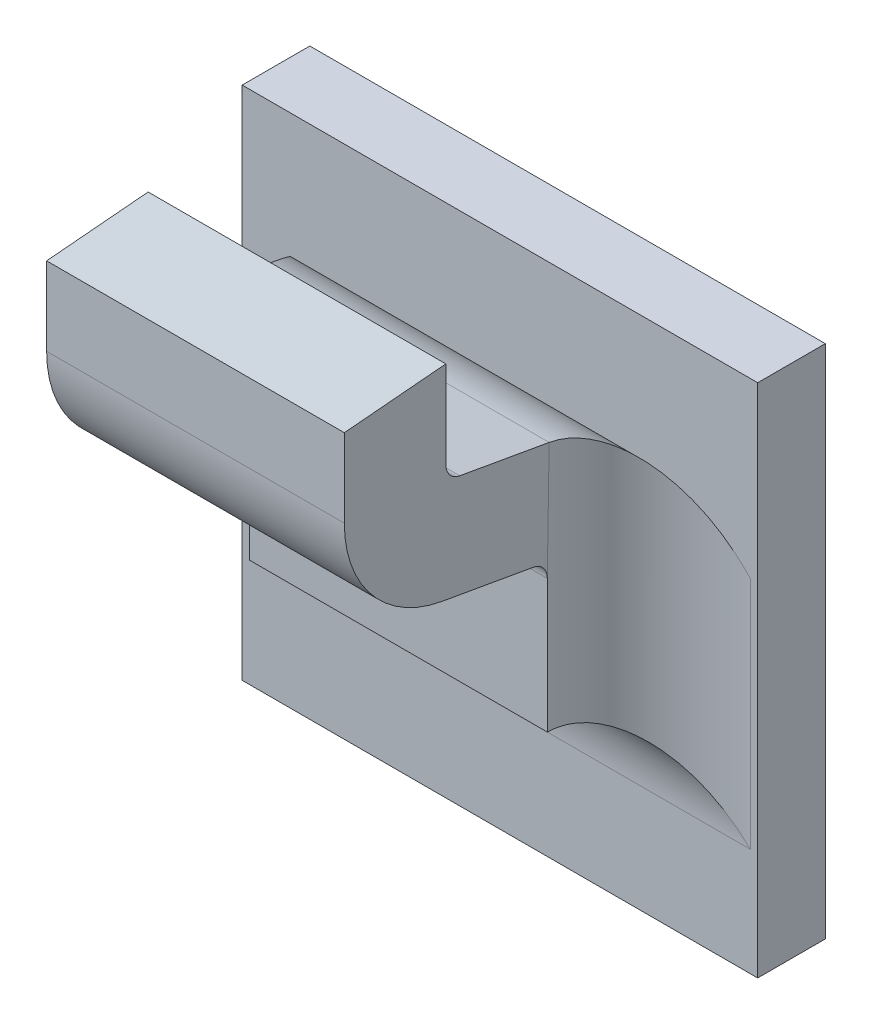
ISO-10303-21;
HEADER;
FILE_DESCRIPTION(('STEP AP214'),'2;1');
FILE_NAME('part.step','',(''),(''),'','','');
FILE_SCHEMA(('AUTOMOTIVE_DESIGN { 1 0 10303 214 1 1 1 1 }'));
ENDSEC;
DATA;
#1=APPLICATION_CONTEXT('core data for automotive mechanical design processes');
#2=APPLICATION_PROTOCOL_DEFINITION('international standard','automotive_design',2000,#1);
#3=PRODUCT_CONTEXT('',#1,'mechanical');
#4=PRODUCT('Part','Part','',(#3));
#5=PRODUCT_RELATED_PRODUCT_CATEGORY('part','',(#4));
#6=PRODUCT_DEFINITION_FORMATION('','',#4);
#7=PRODUCT_DEFINITION_CONTEXT('part definition',#1,'design');
#8=PRODUCT_DEFINITION('design','',#6,#7);
#9=PRODUCT_DEFINITION_SHAPE('','',#8);
#10=(LENGTH_UNIT() NAMED_UNIT(*) SI_UNIT(.MILLI.,.METRE.));
#11=(NAMED_UNIT(*) PLANE_ANGLE_UNIT() SI_UNIT($,.RADIAN.));
#12=(NAMED_UNIT(*) SI_UNIT($,.STERADIAN.) SOLID_ANGLE_UNIT());
#13=UNCERTAINTY_MEASURE_WITH_UNIT(LENGTH_MEASURE(1.E-05),#10,'distance_accuracy_value','');
#14=(GEOMETRIC_REPRESENTATION_CONTEXT(3) GLOBAL_UNCERTAINTY_ASSIGNED_CONTEXT((#13)) GLOBAL_UNIT_ASSIGNED_CONTEXT((#10,
#11,#12)) REPRESENTATION_CONTEXT('',''));
#15=CARTESIAN_POINT('',(0.,0.,0.));
#16=DIRECTION('',(0.,0.,1.));
#17=DIRECTION('',(1.,0.,0.));
#18=AXIS2_PLACEMENT_3D('',#15,#16,#17);
#19=CARTESIAN_POINT('',(0.109690982808015,-0.482280853090536,0.0797273267071123));
#20=DIRECTION('',(1.,0.,0.));
#21=DIRECTION('',(0.,1.,0.));
#22=AXIS2_PLACEMENT_3D('',#19,#20,#21);
#23=CYLINDRICAL_SURFACE('',#22,0.00098425196850394);
#24=DIRECTION('',(1.,0.,0.));
#25=VECTOR('',#24,1.);
#26=CARTESIAN_POINT('',(0.0906358646977785,-0.482280853090536,0.0807115786756163));
#27=LINE('',#26,#25);
#28=CARTESIAN_POINT('',(0.108824841075731,-0.482280853090536,0.0807115786756163));
#29=VERTEX_POINT('',#28);
#30=CARTESIAN_POINT('',(0.091502006430062,-0.482280853090536,0.0807115786756163));
#31=VERTEX_POINT('',#30);
#32=EDGE_CURVE('E182',#29,#31,#27,.F.);
#33=ORIENTED_EDGE('',*,*,#32,.F.);
#34=CARTESIAN_POINT('',(0.108824841075731,-0.482280853090536,0.0797273267071123));
#35=DIRECTION('',(1.,0.,0.));
#36=DIRECTION('',(0.,1.,0.));
#37=AXIS2_PLACEMENT_3D('',#34,#35,#36);
#38=CIRCLE('',#37,0.00098425196850394);
#39=CARTESIAN_POINT('',(0.108824841075731,-0.483250152060037,0.0798982402678082));
#40=VERTEX_POINT('',#39);
#41=EDGE_CURVE('E155',#40,#29,#38,.F.);
#42=ORIENTED_EDGE('',*,*,#41,.F.);
#43=DIRECTION('',(1.,0.,0.));
#44=VECTOR('',#43,1.);
#45=CARTESIAN_POINT('',(0.0906316719131204,-0.483250152060037,0.0798982402678081));
#46=LINE('',#45,#44);
#47=CARTESIAN_POINT('',(0.091502006430062,-0.483250152060037,0.0798982402678082));
#48=VERTEX_POINT('',#47);
#49=EDGE_CURVE('E137',#48,#40,#46,.T.);
#50=ORIENTED_EDGE('',*,*,#49,.F.);
#51=CARTESIAN_POINT('',(0.091502006430062,-0.482280853090536,0.0797273267071123));
#52=DIRECTION('',(1.,0.,0.));
#53=DIRECTION('',(0.,1.,0.));
#54=AXIS2_PLACEMENT_3D('',#51,#52,#53);
#55=CIRCLE('',#54,0.00098425196850394);
#56=EDGE_CURVE('E148',#48,#31,#55,.F.);
#57=ORIENTED_EDGE('',*,*,#56,.T.);
#58=EDGE_LOOP('',(#33,#42,#50,#57));
#59=FACE_BOUND('',#58,.T.);
#60=ADVANCED_FACE('F17',(#59),#23,.F.);
#61=CARTESIAN_POINT('',(0.0906358646977785,-0.482534695884412,0.0807115786756163));
#62=DIRECTION('',(0.,0.,-1.));
#63=DIRECTION('',(0.,1.,0.));
#64=AXIS2_PLACEMENT_3D('',#61,#62,#63);
#65=PLANE('',#64);
#66=ORIENTED_EDGE('',*,*,#32,.T.);
#67=DIRECTION('',(0.,1.,0.));
#68=VECTOR('',#67,1.);
#69=CARTESIAN_POINT('',(0.091502006430062,-0.491658866021041,0.0807115786756163));
#70=LINE('',#69,#68);
#71=CARTESIAN_POINT('',(0.091502006430062,-0.477203997213029,0.0807115786756163));
#72=VERTEX_POINT('',#71);
#73=EDGE_CURVE('E177',#31,#72,#70,.T.);
#74=ORIENTED_EDGE('',*,*,#73,.T.);
#75=DIRECTION('',(1.,0.,0.));
#76=VECTOR('',#75,1.);
#77=CARTESIAN_POINT('',(0.137663423752897,-0.477203997213029,0.0807115786756163));
#78=LINE('',#77,#76);
#79=CARTESIAN_POINT('',(0.108824841075731,-0.477203997213029,0.0807115786756163));
#80=VERTEX_POINT('',#79);
#81=EDGE_CURVE('E170',#72,#80,#78,.T.);
#82=ORIENTED_EDGE('',*,*,#81,.T.);
#83=DIRECTION('',(0.,1.,0.));
#84=VECTOR('',#83,1.);
#85=CARTESIAN_POINT('',(0.108824841075731,-0.491658866021041,0.0807115786756163));
#86=LINE('',#85,#84);
#87=EDGE_CURVE('E189',#29,#80,#86,.T.);
#88=ORIENTED_EDGE('',*,*,#87,.F.);
#89=EDGE_LOOP('',(#66,#74,#82,#88));
#90=FACE_BOUND('',#89,.T.);
#91=ADVANCED_FACE('F376',(#90),#65,.T.);
#92=CARTESIAN_POINT('',(0.137663423752897,-0.477562594630968,0.0848103659183002));
#93=DIRECTION('',(0.,-0.996194698091746,-0.0871557427476516));
#94=DIRECTION('',(0.,0.0871557427476516,-0.996194698091746));
#95=AXIS2_PLACEMENT_3D('',#92,#93,#94);
#96=PLANE('',#95);
#97=DIRECTION('',(0.,-0.0871557427476615,0.996194698091745));
#98=VECTOR('',#97,1.);
#99=CARTESIAN_POINT('',(0.091502006430062,-0.477203997213029,0.0807115786756163));
#100=LINE('',#99,#98);
#101=CARTESIAN_POINT('',(0.091502006430062,-0.477720662548812,0.08661709048664));
#102=VERTEX_POINT('',#101);
#103=EDGE_CURVE('E173',#72,#102,#100,.T.);
#104=ORIENTED_EDGE('',*,*,#103,.T.);
#105=DIRECTION('',(1.,0.,0.));
#106=VECTOR('',#105,1.);
#107=CARTESIAN_POINT('',(0.0906358646977785,-0.477720662548812,0.0866170904866399));
#108=LINE('',#107,#106);
#109=CARTESIAN_POINT('',(0.108824841075731,-0.477720662548812,0.0866170904866399));
#110=VERTEX_POINT('',#109);
#111=EDGE_CURVE('E167',#102,#110,#108,.T.);
#112=ORIENTED_EDGE('',*,*,#111,.T.);
#113=DIRECTION('',(0.,-0.0871557427476615,0.996194698091745));
#114=VECTOR('',#113,1.);
#115=CARTESIAN_POINT('',(0.108824841075731,-0.477203997213029,0.0807115786756163));
#116=LINE('',#115,#114);
#117=EDGE_CURVE('E186',#80,#110,#116,.T.);
#118=ORIENTED_EDGE('',*,*,#117,.F.);
#119=ORIENTED_EDGE('',*,*,#81,.F.);
#120=EDGE_LOOP('',(#104,#112,#118,#119));
#121=FACE_BOUND('',#120,.T.);
#122=ADVANCED_FACE('F380',(#121),#96,.F.);
#123=CARTESIAN_POINT('',(0.0906358646977785,-0.482508862617623,0.0866170904866399));
#124=DIRECTION('',(0.,0.,-1.));
#125=DIRECTION('',(0.,1.,0.));
#126=AXIS2_PLACEMENT_3D('',#123,#124,#125);
#127=PLANE('',#126);
#128=ORIENTED_EDGE('',*,*,#111,.F.);
#129=DIRECTION('',(0.,1.,0.));
#130=VECTOR('',#129,1.);
#131=CARTESIAN_POINT('',(0.091502006430062,-0.491658866021041,0.08661709048664));
#132=LINE('',#131,#130);
#133=CARTESIAN_POINT('',(0.091502006430062,-0.482280853090536,0.0866170904866399));
#134=VERTEX_POINT('',#133);
#135=EDGE_CURVE('E176',#102,#134,#132,.F.);
#136=ORIENTED_EDGE('',*,*,#135,.T.);
#137=DIRECTION('',(1.,0.,0.));
#138=VECTOR('',#137,1.);
#139=CARTESIAN_POINT('',(0.109690982808015,-0.482280853090536,0.0866170904866399));
#140=LINE('',#139,#138);
#141=CARTESIAN_POINT('',(0.108824841075731,-0.482280853090536,0.0866170904866399));
#142=VERTEX_POINT('',#141);
#143=EDGE_CURVE('E165',#142,#134,#140,.F.);
#144=ORIENTED_EDGE('',*,*,#143,.F.);
#145=DIRECTION('',(0.,1.,0.));
#146=VECTOR('',#145,1.);
#147=CARTESIAN_POINT('',(0.108824841075731,-0.491658866021041,0.08661709048664));
#148=LINE('',#147,#146);
#149=EDGE_CURVE('E188',#110,#142,#148,.F.);
#150=ORIENTED_EDGE('',*,*,#149,.F.);
#151=EDGE_LOOP('',(#128,#136,#144,#150));
#152=FACE_BOUND('',#151,.T.);
#153=ADVANCED_FACE('F384',(#152),#127,.F.);
#154=CARTESIAN_POINT('',(0.109690982808015,-0.482280853090536,0.0797273267071123));
#155=DIRECTION('',(1.,0.,0.));
#156=DIRECTION('',(0.,1.,0.));
#157=AXIS2_PLACEMENT_3D('',#154,#155,#156);
#158=CYLINDRICAL_SURFACE('',#157,0.00688976377952756);
#159=CARTESIAN_POINT('',(0.108824841075731,-0.482280853090536,0.0797273267071123));
#160=DIRECTION('',(1.,0.,0.));
#161=DIRECTION('',(0.,1.,0.));
#162=AXIS2_PLACEMENT_3D('',#159,#160,#161);
#163=CIRCLE('',#162,0.00688976377952756);
#164=CARTESIAN_POINT('',(0.108824841075731,-0.489065945877038,0.0809237216319825));
#165=VERTEX_POINT('',#164);
#166=EDGE_CURVE('E146',#142,#165,#163,.T.);
#167=ORIENTED_EDGE('',*,*,#166,.F.);
#168=ORIENTED_EDGE('',*,*,#143,.T.);
#169=CARTESIAN_POINT('',(0.091502006430062,-0.482280853090536,0.0797273267071123));
#170=DIRECTION('',(1.,0.,0.));
#171=DIRECTION('',(0.,1.,0.));
#172=AXIS2_PLACEMENT_3D('',#169,#170,#171);
#173=CIRCLE('',#172,0.00688976377952756);
#174=CARTESIAN_POINT('',(0.091502006430062,-0.489065945877038,0.0809237216319825));
#175=VERTEX_POINT('',#174);
#176=EDGE_CURVE('E235',#134,#175,#173,.T.);
#177=ORIENTED_EDGE('',*,*,#176,.T.);
#178=DIRECTION('',(1.,0.,0.));
#179=VECTOR('',#178,1.);
#180=CARTESIAN_POINT('',(0.0906358646977785,-0.489065945877038,0.0809237216319829));
#181=LINE('',#180,#179);
#182=EDGE_CURVE('E138',#175,#165,#181,.T.);
#183=ORIENTED_EDGE('',*,*,#182,.T.);
#184=EDGE_LOOP('',(#167,#168,#177,#183));
#185=FACE_BOUND('',#184,.T.);
#186=ADVANCED_FACE('F388',(#185),#158,.T.);
#187=CARTESIAN_POINT('',(0.0906358646977785,-0.490048004669866,0.0753541894544217));
#188=DIRECTION('',(0.,0.984807753012208,-0.17364817766693));
#189=DIRECTION('',(0.,0.17364817766693,0.984807753012208));
#190=AXIS2_PLACEMENT_3D('',#187,#188,#189);
#191=PLANE('',#190);
#192=DIRECTION('',(1.,0.,0.));
#193=VECTOR('',#192,1.);
#194=CARTESIAN_POINT('',(0.109690982808015,-0.490001239965446,0.0756194052724009));
#195=LINE('',#194,#193);
#196=CARTESIAN_POINT('',(0.091502006430062,-0.490001239965445,0.0756194052724009));
#197=VERTEX_POINT('',#196);
#198=CARTESIAN_POINT('',(0.108824841075731,-0.490001239965445,0.0756194052724009));
#199=VERTEX_POINT('',#198);
#200=EDGE_CURVE('E127',#197,#199,#195,.T.);
#201=ORIENTED_EDGE('',*,*,#200,.T.);
#202=DIRECTION('',(0.,-0.173648177666803,-0.98480775301223));
#203=VECTOR('',#202,1.);
#204=CARTESIAN_POINT('',(0.108824841075731,-0.489065945877038,0.0809237216319829));
#205=LINE('',#204,#203);
#206=EDGE_CURVE('E130',#165,#199,#205,.T.);
#207=ORIENTED_EDGE('',*,*,#206,.F.);
#208=ORIENTED_EDGE('',*,*,#182,.F.);
#209=DIRECTION('',(0.,-0.173648177666803,-0.98480775301223));
#210=VECTOR('',#209,1.);
#211=CARTESIAN_POINT('',(0.091502006430062,-0.489065945877038,0.0809237216319829));
#212=LINE('',#211,#210);
#213=EDGE_CURVE('E132',#175,#197,#212,.T.);
#214=ORIENTED_EDGE('',*,*,#213,.T.);
#215=EDGE_LOOP('',(#201,#207,#208,#214));
#216=FACE_BOUND('',#215,.T.);
#217=ADVANCED_FACE('F129',(#216),#191,.F.);
#218=CARTESIAN_POINT('',(0.109690982808015,-0.490970538934946,0.0757903188330966));
#219=DIRECTION('',(1.,0.,0.));
#220=DIRECTION('',(0.,1.,0.));
#221=AXIS2_PLACEMENT_3D('',#218,#219,#220);
#222=CYLINDRICAL_SURFACE('',#221,0.00098425196850394);
#223=DIRECTION('',(1.,0.,0.));
#224=VECTOR('',#223,1.);
#225=CARTESIAN_POINT('',(0.0906358646977785,-0.490970538934946,0.0748060668645926));
#226=LINE('',#225,#224);
#227=CARTESIAN_POINT('',(0.091502006430062,-0.490970538934946,0.0748060668645927));
#228=VERTEX_POINT('',#227);
#229=CARTESIAN_POINT('',(0.108824841075731,-0.490970538934946,0.0748060668645926));
#230=VERTEX_POINT('',#229);
#231=EDGE_CURVE('E151',#228,#230,#226,.T.);
#232=ORIENTED_EDGE('',*,*,#231,.T.);
#233=CARTESIAN_POINT('',(0.108824841075731,-0.490970538934946,0.0757903188330966));
#234=DIRECTION('',(1.,0.,0.));
#235=DIRECTION('',(0.,1.,0.));
#236=AXIS2_PLACEMENT_3D('',#233,#234,#235);
#237=CIRCLE('',#236,0.00098425196850394);
#238=EDGE_CURVE('E20',#199,#230,#237,.F.);
#239=ORIENTED_EDGE('',*,*,#238,.F.);
#240=ORIENTED_EDGE('',*,*,#200,.F.);
#241=CARTESIAN_POINT('',(0.091502006430062,-0.490970538934946,0.0757903188330966));
#242=DIRECTION('',(1.,0.,0.));
#243=DIRECTION('',(0.,1.,0.));
#244=AXIS2_PLACEMENT_3D('',#241,#242,#243);
#245=CIRCLE('',#244,0.00098425196850394);
#246=EDGE_CURVE('E232',#197,#228,#245,.F.);
#247=ORIENTED_EDGE('',*,*,#246,.T.);
#248=EDGE_LOOP('',(#232,#239,#240,#247));
#249=FACE_BOUND('',#248,.T.);
#250=ADVANCED_FACE('F150',(#249),#222,.F.);
#251=CARTESIAN_POINT('',(0.0906316719131204,-0.484232210852865,0.0743287080902469));
#252=DIRECTION('',(0.,0.984807753012208,-0.17364817766693));
#253=DIRECTION('',(0.,0.17364817766693,0.984807753012208));
#254=AXIS2_PLACEMENT_3D('',#251,#252,#253);
#255=PLANE('',#254);
#256=DIRECTION('',(0.,0.173648177666938,0.984807753012207));
#257=VECTOR('',#256,1.);
#258=CARTESIAN_POINT('',(0.108824841075731,-0.48414803962147,0.0748060668645927));
#259=LINE('',#258,#257);
#260=CARTESIAN_POINT('',(0.10882674688694,-0.484166742884957,0.0746999953864093));
#261=VERTEX_POINT('',#260);
#262=EDGE_CURVE('E153',#261,#40,#259,.T.);
#263=ORIENTED_EDGE('',*,*,#262,.F.);
#264=DIRECTION('',(1.,0.,0.));
#265=VECTOR('',#264,1.);
#266=CARTESIAN_POINT('',(0.116187045800141,-0.484185446148445,0.0745939239082261));
#267=LINE('',#266,#265);
#268=CARTESIAN_POINT('',(0.0915001006188538,-0.484166742884957,0.0746999953864093));
#269=VERTEX_POINT('',#268);
#270=EDGE_CURVE('E264',#269,#261,#267,.T.);
#271=ORIENTED_EDGE('',*,*,#270,.F.);
#272=DIRECTION('',(0.,0.173648177666938,0.984807753012207));
#273=VECTOR('',#272,1.);
#274=CARTESIAN_POINT('',(0.091502006430062,-0.48414803962147,0.0748060668645927));
#275=LINE('',#274,#273);
#276=EDGE_CURVE('E234',#269,#48,#275,.T.);
#277=ORIENTED_EDGE('',*,*,#276,.T.);
#278=ORIENTED_EDGE('',*,*,#49,.T.);
#279=EDGE_LOOP('',(#263,#271,#277,#278));
#280=FACE_BOUND('',#279,.T.);
#281=ADVANCED_FACE('F373',(#280),#255,.T.);
#282=CARTESIAN_POINT('',(0.108824841075731,-0.491658866021041,0.0742155156834903));
#283=DIRECTION('',(1.,0.,0.));
#284=DIRECTION('',(0.,1.,0.));
#285=AXIS2_PLACEMENT_3D('',#282,#283,#284);
#286=PLANE('',#285);
#287=ORIENTED_EDGE('',*,*,#166,.T.);
#288=ORIENTED_EDGE('',*,*,#206,.T.);
#289=ORIENTED_EDGE('',*,*,#238,.T.);
#290=DIRECTION('',(0.,-1.,0.));
#291=VECTOR('',#290,1.);
#292=CARTESIAN_POINT('',(0.108824841075731,-0.505642557779639,0.0748060668645926));
#293=LINE('',#292,#291);
#294=EDGE_CURVE('E271',#230,#261,#293,.F.);
#295=ORIENTED_EDGE('',*,*,#294,.T.);
#296=ORIENTED_EDGE('',*,*,#262,.T.);
#297=ORIENTED_EDGE('',*,*,#41,.T.);
#298=ORIENTED_EDGE('',*,*,#87,.T.);
#299=ORIENTED_EDGE('',*,*,#117,.T.);
#300=ORIENTED_EDGE('',*,*,#149,.T.);
#301=EDGE_LOOP('',(#287,#288,#289,#295,#296,#297,#298,#299,#300));
#302=FACE_BOUND('',#301,.T.);
#303=ADVANCED_FACE('F142',(#302),#286,.T.);
#304=CARTESIAN_POINT('',(0.091502006430062,-0.491658866021041,0.0742155156834903));
#305=DIRECTION('',(1.,0.,0.));
#306=DIRECTION('',(0.,1.,0.));
#307=AXIS2_PLACEMENT_3D('',#304,#305,#306);
#308=PLANE('',#307);
#309=DIRECTION('',(0.,1.,0.));
#310=VECTOR('',#309,1.);
#311=CARTESIAN_POINT('',(0.091502006430062,-0.483124491137747,0.0748060668645927));
#312=LINE('',#311,#310);
#313=EDGE_CURVE('E290',#269,#228,#312,.F.);
#314=ORIENTED_EDGE('',*,*,#313,.T.);
#315=ORIENTED_EDGE('',*,*,#246,.F.);
#316=ORIENTED_EDGE('',*,*,#213,.F.);
#317=ORIENTED_EDGE('',*,*,#176,.F.);
#318=ORIENTED_EDGE('',*,*,#135,.F.);
#319=ORIENTED_EDGE('',*,*,#103,.F.);
#320=ORIENTED_EDGE('',*,*,#73,.F.);
#321=ORIENTED_EDGE('',*,*,#56,.F.);
#322=ORIENTED_EDGE('',*,*,#276,.F.);
#323=EDGE_LOOP('',(#314,#315,#316,#317,#318,#319,#320,#321,#322));
#324=FACE_BOUND('',#323,.T.);
#325=ADVANCED_FACE('F371',(#324),#308,.F.);
#326=CARTESIAN_POINT('',(0.0906358646977785,-0.49910064541239,0.0748060668645926));
#327=DIRECTION('',(0.,0.,-1.));
#328=DIRECTION('',(0.,1.,0.));
#329=AXIS2_PLACEMENT_3D('',#326,#327,#328);
#330=PLANE('',#329);
#331=DIRECTION('',(-1.,0.,0.));
#332=VECTOR('',#331,1.);
#333=CARTESIAN_POINT('',(0.0841398017056525,-0.498713497484892,0.0748060668645926));
#334=LINE('',#333,#332);
#335=CARTESIAN_POINT('',(0.091502006430062,-0.498713497484892,0.0748060668645926));
#336=VERTEX_POINT('',#335);
#337=CARTESIAN_POINT('',(0.108824841075731,-0.498713497484892,0.0748060668645926));
#338=VERTEX_POINT('',#337);
#339=EDGE_CURVE('E275',#336,#338,#334,.F.);
#340=ORIENTED_EDGE('',*,*,#339,.T.);
#341=DIRECTION('',(0.,-1.,0.));
#342=VECTOR('',#341,1.);
#343=CARTESIAN_POINT('',(0.108824841075731,-0.505642557779639,0.0748060668645926));
#344=LINE('',#343,#342);
#345=EDGE_CURVE('E268',#338,#230,#344,.F.);
#346=ORIENTED_EDGE('',*,*,#345,.T.);
#347=ORIENTED_EDGE('',*,*,#231,.F.);
#348=DIRECTION('',(0.,1.,0.));
#349=VECTOR('',#348,1.);
#350=CARTESIAN_POINT('',(0.091502006430062,-0.483124491137747,0.0748060668645926));
#351=LINE('',#350,#349);
#352=EDGE_CURVE('E293',#228,#336,#351,.F.);
#353=ORIENTED_EDGE('',*,*,#352,.T.);
#354=EDGE_LOOP('',(#340,#346,#347,#353));
#355=FACE_BOUND('',#354,.T.);
#356=ADVANCED_FACE('F369',(#355),#330,.F.);
#357=CARTESIAN_POINT('',(0.116187045800141,-0.490970538934946,0.0757903188330966));
#358=DIRECTION('',(1.,0.,0.));
#359=DIRECTION('',(0.,1.,0.));
#360=AXIS2_PLACEMENT_3D('',#357,#358,#359);
#361=CYLINDRICAL_SURFACE('',#360,0.00688976377952756);
#362=ORIENTED_EDGE('',*,*,#270,.T.);
#363=CARTESIAN_POINT('',(0.10882584705188,-0.484167631527071,0.0747001216257358));
#364=CARTESIAN_POINT('',(0.108830746400047,-0.484214408974995,0.0744052234333631));
#365=CARTESIAN_POINT('',(0.108858349030783,-0.484280966886792,0.0741150341517891));
#366=CARTESIAN_POINT('',(0.108952289382906,-0.484447482121032,0.073553844729337));
#367=CARTESIAN_POINT('',(0.109018258902216,-0.484547118148503,0.0732826892737776));
#368=CARTESIAN_POINT('',(0.109182242620427,-0.484774233375055,0.0727646055784552));
#369=CARTESIAN_POINT('',(0.109280119745007,-0.484901592711233,0.0725175794773051));
#370=CARTESIAN_POINT('',(0.109501721201638,-0.485178958131144,0.0720485533086557));
#371=CARTESIAN_POINT('',(0.109625512286216,-0.485329022418919,0.0718266201983146));
#372=CARTESIAN_POINT('',(0.109961780246565,-0.485728040852456,0.0713022915327615));
#373=CARTESIAN_POINT('',(0.110187229821375,-0.485988312130857,0.0710168133445037));
#374=CARTESIAN_POINT('',(0.110669306450927,-0.486535947935682,0.070504056702723));
#375=CARTESIAN_POINT('',(0.110926004972526,-0.486823374216995,0.0702769154978245));
#376=CARTESIAN_POINT('',(0.111560055176599,-0.487527037812419,0.0698026326616958));
#377=CARTESIAN_POINT('',(0.111946643806099,-0.487951268913421,0.0695797433223629));
#378=CARTESIAN_POINT('',(0.112740499974624,-0.488817388979215,0.0692289934880923));
#379=CARTESIAN_POINT('',(0.113147751769603,-0.489259264447,0.0691010617693635));
#380=CARTESIAN_POINT('',(0.113829419657663,-0.489997147024509,0.0689631980798835));
#381=CARTESIAN_POINT('',(0.114101299537579,-0.490291001061431,0.0689278051732856));
#382=CARTESIAN_POINT('',(0.114492532956124,-0.490713663984163,0.0689041494171859));
#383=CARTESIAN_POINT('',(0.114611448383415,-0.490842107141949,0.068900564537093));
#384=CARTESIAN_POINT('',(0.114730352886755,-0.490970538934946,0.068900555053569));
#385=B_SPLINE_CURVE_WITH_KNOTS('',3,(#363,#364,#365,#366,#367,#368,#369,#370,#371,#372,#373,
#374,#375,#376,#377,#378,#379,#380,#381,#382,#383,#384),.UNSPECIFIED.,.F.,.F.,(4,2,2,2,2,2,2,2,
2,2,4),(0.,0.000892674275674719,0.00177691981761761,0.00265741564567001,0.00354020811045546,
0.00487460341316197,0.00621210995073976,0.00804949445936676,0.00988549942521252,0.011089431284,
0.0116145091100796),.UNSPECIFIED.);
#386=CARTESIAN_POINT('',(0.114730352886755,-0.490970538934946,0.068900555053569));
#387=VERTEX_POINT('',#386);
#388=EDGE_CURVE('E231',#261,#387,#385,.T.);
#389=ORIENTED_EDGE('',*,*,#388,.T.);
#390=DIRECTION('',(1.,0.,0.));
#391=VECTOR('',#390,1.);
#392=CARTESIAN_POINT('',(0.0836634237528968,-0.490970538934946,0.068900555053569));
#393=LINE('',#392,#391);
#394=CARTESIAN_POINT('',(0.0855964946190384,-0.490970538934946,0.068900555053569));
#395=VERTEX_POINT('',#394);
#396=EDGE_CURVE('E195',#395,#387,#393,.T.);
#397=ORIENTED_EDGE('',*,*,#396,.F.);
#398=CARTESIAN_POINT('',(0.0915010004539131,-0.484167631527071,0.0747001216257358));
#399=CARTESIAN_POINT('',(0.091496101105746,-0.484214408974995,0.0744052234333631));
#400=CARTESIAN_POINT('',(0.0914684984750102,-0.484280966886792,0.0741150341517891));
#401=CARTESIAN_POINT('',(0.0913745581228873,-0.484447482121032,0.073553844729337));
#402=CARTESIAN_POINT('',(0.0913085886035777,-0.484547118148504,0.0732826892737777));
#403=CARTESIAN_POINT('',(0.091144604885366,-0.484774233375055,0.0727646055784552));
#404=CARTESIAN_POINT('',(0.0910467277607868,-0.484901592711233,0.0725175794773052));
#405=CARTESIAN_POINT('',(0.0908251263041557,-0.485178958131144,0.0720485533086558));
#406=CARTESIAN_POINT('',(0.0907013352195773,-0.485329022418919,0.0718266201983146));
#407=CARTESIAN_POINT('',(0.0903650672592285,-0.485728040852456,0.0713022915327616));
#408=CARTESIAN_POINT('',(0.0901396176844188,-0.485988312130857,0.0710168133445038));
#409=CARTESIAN_POINT('',(0.0896575410548667,-0.486535947935682,0.070504056702723));
#410=CARTESIAN_POINT('',(0.0894008425332673,-0.486823374216995,0.0702769154978246));
#411=CARTESIAN_POINT('',(0.0887667923291948,-0.487527037812419,0.0698026326616959));
#412=CARTESIAN_POINT('',(0.0883802036996938,-0.487951268913421,0.0695797433223629));
#413=CARTESIAN_POINT('',(0.0875863475311694,-0.488817388979215,0.0692289934880923));
#414=CARTESIAN_POINT('',(0.0871790957361905,-0.489259264447,0.0691010617693636));
#415=CARTESIAN_POINT('',(0.0864974278481303,-0.489997147024509,0.0689631980798835));
#416=CARTESIAN_POINT('',(0.0862255479682135,-0.49029100106143,0.0689278051732857));
#417=CARTESIAN_POINT('',(0.0858343145496691,-0.490713663984162,0.0689041494171859));
#418=CARTESIAN_POINT('',(0.085715399122378,-0.490842107141948,0.0689005645370931));
#419=CARTESIAN_POINT('',(0.0855964946190384,-0.490970538934946,0.0689005550535691));
#420=B_SPLINE_CURVE_WITH_KNOTS('',3,(#398,#399,#400,#401,#402,#403,#404,#405,#406,#407,#408,
#409,#410,#411,#412,#413,#414,#415,#416,#417,#418,#419),.UNSPECIFIED.,.F.,.F.,(4,2,2,2,2,2,2,2,
2,2,4),(0.,0.000892674275674704,0.0017769198176176,0.00265741564566993,0.00354020811045541,
0.00487460341316192,0.00621210995073967,0.00804949445936671,0.00988549942521248,
0.0110894312839999,0.0116145091100796),.UNSPECIFIED.);
#421=EDGE_CURVE('E192',#395,#269,#420,.F.);
#422=ORIENTED_EDGE('',*,*,#421,.T.);
#423=EDGE_LOOP('',(#362,#389,#397,#422));
#424=FACE_BOUND('',#423,.T.);
#425=ADVANCED_FACE('F205',(#424),#361,.T.);
#426=CARTESIAN_POINT('',(0.114730352886755,-0.505642557779639,0.0748060668645926));
#427=DIRECTION('',(0.,-1.,0.));
#428=DIRECTION('',(1.,0.,0.));
#429=AXIS2_PLACEMENT_3D('',#426,#427,#428);
#430=CYLINDRICAL_SURFACE('',#429,0.00590551181102362);
#431=ORIENTED_EDGE('',*,*,#345,.F.);
#432=CARTESIAN_POINT('',(0.114730352886755,-0.504619009295916,0.0748060668645926));
#433=DIRECTION('',(-0.707106781186548,-0.707106781186547,0.));
#434=DIRECTION('',(0.707106781186547,-0.707106781186548,0.));
#435=AXIS2_PLACEMENT_3D('',#432,#433,#434);
#436=ELLIPSE('',#435,0.0083516548959041,0.00590551181102362);
#437=CARTESIAN_POINT('',(0.114730352886755,-0.504619009295916,0.068900555053569));
#438=VERTEX_POINT('',#437);
#439=EDGE_CURVE('E281',#338,#438,#436,.T.);
#440=ORIENTED_EDGE('',*,*,#439,.T.);
#441=DIRECTION('',(0.,-1.,0.));
#442=VECTOR('',#441,1.);
#443=CARTESIAN_POINT('',(0.114730352886755,-0.479390254770699,0.068900555053569));
#444=LINE('',#443,#442);
#445=EDGE_CURVE('E276',#387,#438,#444,.T.);
#446=ORIENTED_EDGE('',*,*,#445,.F.);
#447=ORIENTED_EDGE('',*,*,#388,.F.);
#448=ORIENTED_EDGE('',*,*,#294,.F.);
#449=EDGE_LOOP('',(#431,#440,#446,#447,#448));
#450=FACE_BOUND('',#449,.T.);
#451=ADVANCED_FACE('F219',(#450),#430,.F.);
#452=CARTESIAN_POINT('',(0.0841398017056525,-0.504619009295916,0.0748060668645926));
#453=DIRECTION('',(-1.,0.,0.));
#454=DIRECTION('',(0.,-1.,0.));
#455=AXIS2_PLACEMENT_3D('',#452,#453,#454);
#456=CYLINDRICAL_SURFACE('',#455,0.00590551181102362);
#457=DIRECTION('',(1.,0.,0.));
#458=VECTOR('',#457,1.);
#459=CARTESIAN_POINT('',(0.0836634237528968,-0.504619009295916,0.068900555053569));
#460=LINE('',#459,#458);
#461=CARTESIAN_POINT('',(0.0855964946190384,-0.504619009295916,0.068900555053569));
#462=VERTEX_POINT('',#461);
#463=EDGE_CURVE('E278',#438,#462,#460,.F.);
#464=ORIENTED_EDGE('',*,*,#463,.F.);
#465=ORIENTED_EDGE('',*,*,#439,.F.);
#466=ORIENTED_EDGE('',*,*,#339,.F.);
#467=CARTESIAN_POINT('',(0.0855964946190384,-0.504619009295916,0.0748060668645927));
#468=DIRECTION('',(-0.707106781186547,0.707106781186548,0.));
#469=DIRECTION('',(-0.707106781186548,-0.707106781186547,0.));
#470=AXIS2_PLACEMENT_3D('',#467,#468,#469);
#471=ELLIPSE('',#470,0.0083516548959041,0.00590551181102362);
#472=EDGE_CURVE('E196',#336,#462,#471,.T.);
#473=ORIENTED_EDGE('',*,*,#472,.T.);
#474=EDGE_LOOP('',(#464,#465,#466,#473));
#475=FACE_BOUND('',#474,.T.);
#476=ADVANCED_FACE('F215',(#475),#456,.F.);
#477=CARTESIAN_POINT('',(0.0855964946190384,-0.483124491137747,0.0748060668645927));
#478=DIRECTION('',(0.,1.,0.));
#479=DIRECTION('',(-1.,0.,0.));
#480=AXIS2_PLACEMENT_3D('',#477,#478,#479);
#481=CYLINDRICAL_SURFACE('',#480,0.00590551181102362);
#482=DIRECTION('',(0.,-1.,0.));
#483=VECTOR('',#482,1.);
#484=CARTESIAN_POINT('',(0.0855964946190384,-0.479390254770699,0.068900555053569));
#485=LINE('',#484,#483);
#486=EDGE_CURVE('E283',#462,#395,#485,.F.);
#487=ORIENTED_EDGE('',*,*,#486,.F.);
#488=ORIENTED_EDGE('',*,*,#472,.F.);
#489=ORIENTED_EDGE('',*,*,#352,.F.);
#490=ORIENTED_EDGE('',*,*,#313,.F.);
#491=ORIENTED_EDGE('',*,*,#421,.F.);
#492=EDGE_LOOP('',(#487,#488,#489,#490,#491));
#493=FACE_BOUND('',#492,.T.);
#494=ADVANCED_FACE('F209',(#493),#481,.F.);
#495=CARTESIAN_POINT('',(0.0836634237528968,-0.479390254770699,0.068900555053569));
#496=DIRECTION('',(0.,0.,1.));
#497=DIRECTION('',(0.,-1.,0.));
#498=AXIS2_PLACEMENT_3D('',#495,#496,#497);
#499=PLANE('',#498);
#500=ORIENTED_EDGE('',*,*,#463,.T.);
#501=ORIENTED_EDGE('',*,*,#486,.T.);
#502=ORIENTED_EDGE('',*,*,#396,.T.);
#503=ORIENTED_EDGE('',*,*,#445,.T.);
#504=EDGE_LOOP('',(#500,#501,#502,#503));
#505=FACE_BOUND('',#504,.T.);
#506=DIRECTION('',(0.,-1.,0.));
#507=VECTOR('',#506,1.);
#508=CARTESIAN_POINT('',(0.115163423752897,-0.479390254770699,0.068900555053569));
#509=LINE('',#508,#507);
#510=CARTESIAN_POINT('',(0.115163423752897,-0.510890254770699,0.068900555053569));
#511=VERTEX_POINT('',#510);
#512=CARTESIAN_POINT('',(0.115163423752897,-0.480890254770699,0.068900555053569));
#513=VERTEX_POINT('',#512);
#514=EDGE_CURVE('E300',#511,#513,#509,.F.);
#515=ORIENTED_EDGE('',*,*,#514,.T.);
#516=DIRECTION('',(1.,0.,0.));
#517=VECTOR('',#516,1.);
#518=CARTESIAN_POINT('',(0.0836634237528968,-0.480890254770699,0.068900555053569));
#519=LINE('',#518,#517);
#520=CARTESIAN_POINT('',(0.0851634237528964,-0.480890254770699,0.068900555053569));
#521=VERTEX_POINT('',#520);
#522=EDGE_CURVE('E305',#513,#521,#519,.F.);
#523=ORIENTED_EDGE('',*,*,#522,.T.);
#524=DIRECTION('',(0.,1.,0.));
#525=VECTOR('',#524,1.);
#526=CARTESIAN_POINT('',(0.0851634237528964,-0.512390254770699,0.068900555053569));
#527=LINE('',#526,#525);
#528=CARTESIAN_POINT('',(0.0851634237528964,-0.510890254770699,0.068900555053569));
#529=VERTEX_POINT('',#528);
#530=EDGE_CURVE('E308',#521,#529,#527,.F.);
#531=ORIENTED_EDGE('',*,*,#530,.T.);
#532=DIRECTION('',(-1.,0.,0.));
#533=VECTOR('',#532,1.);
#534=CARTESIAN_POINT('',(0.116663423752897,-0.510890254770699,0.068900555053569));
#535=LINE('',#534,#533);
#536=EDGE_CURVE('E286',#529,#511,#535,.F.);
#537=ORIENTED_EDGE('',*,*,#536,.T.);
#538=EDGE_LOOP('',(#515,#523,#531,#537));
#539=FACE_BOUND('',#538,.T.);
#540=ADVANCED_FACE('F214',(#505,#539),#499,.T.);
#541=CARTESIAN_POINT('',(0.116663423752897,-0.510890254770699,0.0647666967858525));
#542=DIRECTION('',(0.,1.,0.));
#543=DIRECTION('',(-1.,0.,0.));
#544=AXIS2_PLACEMENT_3D('',#541,#542,#543);
#545=PLANE('',#544);
#546=DIRECTION('',(0.,0.,1.));
#547=VECTOR('',#546,1.);
#548=CARTESIAN_POINT('',(0.115163423752897,-0.510890254770699,0.0647666967858525));
#549=LINE('',#548,#547);
#550=CARTESIAN_POINT('',(0.115163423752897,-0.510890254770699,0.0649635471795533));
#551=VERTEX_POINT('',#550);
#552=EDGE_CURVE('E297',#551,#511,#549,.T.);
#553=ORIENTED_EDGE('',*,*,#552,.T.);
#554=ORIENTED_EDGE('',*,*,#536,.F.);
#555=DIRECTION('',(0.,0.,1.));
#556=VECTOR('',#555,1.);
#557=CARTESIAN_POINT('',(0.0851634237528964,-0.510890254770699,0.0647666967858525));
#558=LINE('',#557,#556);
#559=CARTESIAN_POINT('',(0.0851634237528964,-0.510890254770699,0.0649635471795533));
#560=VERTEX_POINT('',#559);
#561=EDGE_CURVE('E311',#529,#560,#558,.F.);
#562=ORIENTED_EDGE('',*,*,#561,.T.);
#563=DIRECTION('',(1.,0.,0.));
#564=VECTOR('',#563,1.);
#565=CARTESIAN_POINT('',(0.0836634237528968,-0.510890254770699,0.0649635471795533));
#566=LINE('',#565,#564);
#567=EDGE_CURVE('E314',#560,#551,#566,.T.);
#568=ORIENTED_EDGE('',*,*,#567,.T.);
#569=EDGE_LOOP('',(#553,#554,#562,#568));
#570=FACE_BOUND('',#569,.T.);
#571=ADVANCED_FACE('F332',(#570),#545,.F.);
#572=CARTESIAN_POINT('',(0.115163423752897,-0.479390254770699,0.0647666967858525));
#573=DIRECTION('',(-1.,0.,0.));
#574=DIRECTION('',(0.,-1.,0.));
#575=AXIS2_PLACEMENT_3D('',#572,#573,#574);
#576=PLANE('',#575);
#577=DIRECTION('',(0.,0.,1.));
#578=VECTOR('',#577,1.);
#579=CARTESIAN_POINT('',(0.115163423752897,-0.480890254770699,0.0647666967858525));
#580=LINE('',#579,#578);
#581=CARTESIAN_POINT('',(0.115163423752897,-0.480890254770699,0.0649635471795533));
#582=VERTEX_POINT('',#581);
#583=EDGE_CURVE('E302',#582,#513,#580,.T.);
#584=ORIENTED_EDGE('',*,*,#583,.T.);
#585=ORIENTED_EDGE('',*,*,#514,.F.);
#586=ORIENTED_EDGE('',*,*,#552,.F.);
#587=DIRECTION('',(0.,-1.,0.));
#588=VECTOR('',#587,1.);
#589=CARTESIAN_POINT('',(0.115163423752897,-0.479390254770699,0.0649635471795533));
#590=LINE('',#589,#588);
#591=EDGE_CURVE('E317',#551,#582,#590,.F.);
#592=ORIENTED_EDGE('',*,*,#591,.T.);
#593=EDGE_LOOP('',(#584,#585,#586,#592));
#594=FACE_BOUND('',#593,.T.);
#595=ADVANCED_FACE('F329',(#594),#576,.F.);
#596=CARTESIAN_POINT('',(0.0836634237528968,-0.480890254770699,0.0647666967858525));
#597=DIRECTION('',(0.,-1.,0.));
#598=DIRECTION('',(1.,0.,0.));
#599=AXIS2_PLACEMENT_3D('',#596,#597,#598);
#600=PLANE('',#599);
#601=DIRECTION('',(0.,0.,1.));
#602=VECTOR('',#601,1.);
#603=CARTESIAN_POINT('',(0.0851634237528964,-0.480890254770699,0.0647666967858525));
#604=LINE('',#603,#602);
#605=CARTESIAN_POINT('',(0.0851634237528964,-0.480890254770699,0.0649635471795533));
#606=VERTEX_POINT('',#605);
#607=EDGE_CURVE('E34',#606,#521,#604,.T.);
#608=ORIENTED_EDGE('',*,*,#607,.T.);
#609=ORIENTED_EDGE('',*,*,#522,.F.);
#610=ORIENTED_EDGE('',*,*,#583,.F.);
#611=DIRECTION('',(1.,0.,0.));
#612=VECTOR('',#611,1.);
#613=CARTESIAN_POINT('',(0.0836634237528968,-0.480890254770699,0.0649635471795533));
#614=LINE('',#613,#612);
#615=EDGE_CURVE('E26',#582,#606,#614,.F.);
#616=ORIENTED_EDGE('',*,*,#615,.T.);
#617=EDGE_LOOP('',(#608,#609,#610,#616));
#618=FACE_BOUND('',#617,.T.);
#619=ADVANCED_FACE('F323',(#618),#600,.F.);
#620=CARTESIAN_POINT('',(0.0851634237528964,-0.512390254770699,0.0647666967858525));
#621=DIRECTION('',(1.,0.,0.));
#622=DIRECTION('',(0.,1.,0.));
#623=AXIS2_PLACEMENT_3D('',#620,#621,#622);
#624=PLANE('',#623);
#625=ORIENTED_EDGE('',*,*,#561,.F.);
#626=ORIENTED_EDGE('',*,*,#530,.F.);
#627=ORIENTED_EDGE('',*,*,#607,.F.);
#628=DIRECTION('',(0.,-1.,0.));
#629=VECTOR('',#628,1.);
#630=CARTESIAN_POINT('',(0.0851634237528964,-0.479390254770699,0.0649635471795533));
#631=LINE('',#630,#629);
#632=EDGE_CURVE('E11',#606,#560,#631,.T.);
#633=ORIENTED_EDGE('',*,*,#632,.T.);
#634=EDGE_LOOP('',(#625,#626,#627,#633));
#635=FACE_BOUND('',#634,.T.);
#636=ADVANCED_FACE('F334',(#635),#624,.F.);
#637=CARTESIAN_POINT('',(0.0836634237528968,-0.479390254770699,0.0649635471795533));
#638=DIRECTION('',(0.,0.,1.));
#639=DIRECTION('',(0.,-1.,0.));
#640=AXIS2_PLACEMENT_3D('',#637,#638,#639);
#641=PLANE('',#640);
#642=ORIENTED_EDGE('',*,*,#615,.F.);
#643=ORIENTED_EDGE('',*,*,#591,.F.);
#644=ORIENTED_EDGE('',*,*,#567,.F.);
#645=ORIENTED_EDGE('',*,*,#632,.F.);
#646=EDGE_LOOP('',(#642,#643,#644,#645));
#647=FACE_BOUND('',#646,.T.);
#648=ADVANCED_FACE('F327',(#647),#641,.F.);
#649=CLOSED_SHELL('',(#60,#91,#122,#153,#186,#217,#250,#281,#303,#325,#356,#425,#451,#476,#494,
#540,#571,#595,#619,#636,#648));
#650=MANIFOLD_SOLID_BREP('B1',#649);
#651=ADVANCED_BREP_SHAPE_REPRESENTATION('',(#18,#650),#14);
#652=SHAPE_DEFINITION_REPRESENTATION(#9,#651);
ENDSEC;
END-ISO-10303-21;
